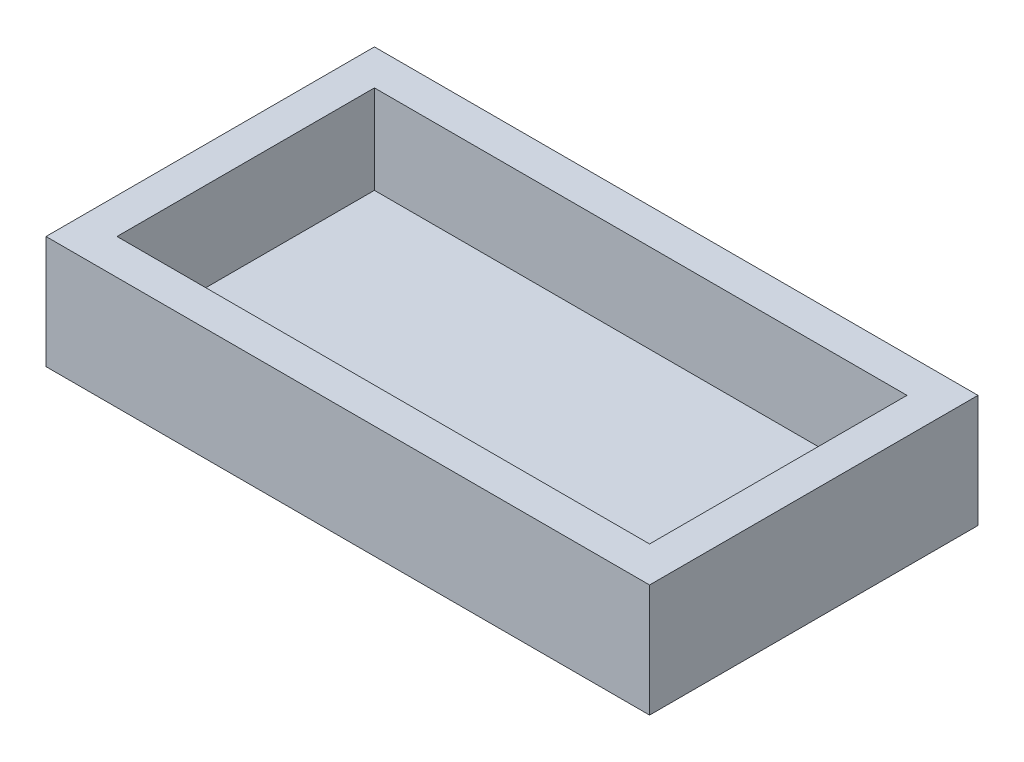
ISO-10303-21;
HEADER;
FILE_DESCRIPTION(('STEP AP214'),'2;1');
FILE_NAME('part.step','',(''),(''),'','','');
FILE_SCHEMA(('AUTOMOTIVE_DESIGN { 1 0 10303 214 1 1 1 1 }'));
ENDSEC;
DATA;
#1=APPLICATION_CONTEXT('core data for automotive mechanical design processes');
#2=APPLICATION_PROTOCOL_DEFINITION('international standard','automotive_design',2000,#1);
#3=PRODUCT_CONTEXT('',#1,'mechanical');
#4=PRODUCT('Part','Part','',(#3));
#5=PRODUCT_RELATED_PRODUCT_CATEGORY('part','',(#4));
#6=PRODUCT_DEFINITION_FORMATION('','',#4);
#7=PRODUCT_DEFINITION_CONTEXT('part definition',#1,'design');
#8=PRODUCT_DEFINITION('design','',#6,#7);
#9=PRODUCT_DEFINITION_SHAPE('','',#8);
#10=(LENGTH_UNIT() NAMED_UNIT(*) SI_UNIT(.MILLI.,.METRE.));
#11=(NAMED_UNIT(*) PLANE_ANGLE_UNIT() SI_UNIT($,.RADIAN.));
#12=(NAMED_UNIT(*) SI_UNIT($,.STERADIAN.) SOLID_ANGLE_UNIT());
#13=UNCERTAINTY_MEASURE_WITH_UNIT(LENGTH_MEASURE(1.E-05),#10,'distance_accuracy_value','');
#14=(GEOMETRIC_REPRESENTATION_CONTEXT(3) GLOBAL_UNCERTAINTY_ASSIGNED_CONTEXT((#13)) GLOBAL_UNIT_ASSIGNED_CONTEXT((#10,
#11,#12)) REPRESENTATION_CONTEXT('',''));
#15=CARTESIAN_POINT('',(0.,0.,0.));
#16=DIRECTION('',(0.,0.,1.));
#17=DIRECTION('',(1.,0.,0.));
#18=AXIS2_PLACEMENT_3D('',#15,#16,#17);
#19=CARTESIAN_POINT('',(30.,6.35,0.));
#20=DIRECTION('',(-1.,0.,0.));
#21=DIRECTION('',(0.,0.,1.));
#22=AXIS2_PLACEMENT_3D('',#19,#20,#21);
#23=PLANE('',#22);
#24=DIRECTION('',(0.,-1.,0.));
#25=VECTOR('',#24,1.);
#26=CARTESIAN_POINT('',(30.,6.35,-14.5));
#27=LINE('',#26,#25);
#28=CARTESIAN_POINT('',(30.,6.35,-14.5));
#29=VERTEX_POINT('',#28);
#30=CARTESIAN_POINT('',(30.,1.35,-14.5));
#31=VERTEX_POINT('',#30);
#32=EDGE_CURVE('E121',#29,#31,#27,.T.);
#33=ORIENTED_EDGE('',*,*,#32,.T.);
#34=DIRECTION('',(0.,0.,-1.));
#35=VECTOR('',#34,1.);
#36=CARTESIAN_POINT('',(30.,1.35,0.));
#37=LINE('',#36,#35);
#38=CARTESIAN_POINT('',(30.,1.35,0.));
#39=VERTEX_POINT('',#38);
#40=EDGE_CURVE('E106',#39,#31,#37,.T.);
#41=ORIENTED_EDGE('',*,*,#40,.F.);
#42=DIRECTION('',(0.,-1.,0.));
#43=VECTOR('',#42,1.);
#44=CARTESIAN_POINT('',(30.,6.35,0.));
#45=LINE('',#44,#43);
#46=CARTESIAN_POINT('',(30.,6.35,0.));
#47=VERTEX_POINT('',#46);
#48=EDGE_CURVE('E229',#47,#39,#45,.T.);
#49=ORIENTED_EDGE('',*,*,#48,.F.);
#50=DIRECTION('',(0.,0.,-1.));
#51=VECTOR('',#50,1.);
#52=CARTESIAN_POINT('',(30.,6.35,0.));
#53=LINE('',#52,#51);
#54=EDGE_CURVE('E128',#47,#29,#53,.T.);
#55=ORIENTED_EDGE('',*,*,#54,.T.);
#56=EDGE_LOOP('',(#33,#41,#49,#55));
#57=FACE_BOUND('',#56,.T.);
#58=ADVANCED_FACE('F42',(#57),#23,.T.);
#59=CARTESIAN_POINT('',(0.,6.35,-14.5));
#60=DIRECTION('',(0.,0.,1.));
#61=DIRECTION('',(1.,0.,0.));
#62=AXIS2_PLACEMENT_3D('',#59,#60,#61);
#63=PLANE('',#62);
#64=DIRECTION('',(0.,-1.,0.));
#65=VECTOR('',#64,1.);
#66=CARTESIAN_POINT('',(0.,6.35,-14.5));
#67=LINE('',#66,#65);
#68=CARTESIAN_POINT('',(0.,6.35,-14.5));
#69=VERTEX_POINT('',#68);
#70=CARTESIAN_POINT('',(0.,1.35,-14.5));
#71=VERTEX_POINT('',#70);
#72=EDGE_CURVE('E124',#69,#71,#67,.T.);
#73=ORIENTED_EDGE('',*,*,#72,.T.);
#74=DIRECTION('',(-1.,0.,0.));
#75=VECTOR('',#74,1.);
#76=CARTESIAN_POINT('',(0.,1.35,-14.5));
#77=LINE('',#76,#75);
#78=EDGE_CURVE('E109',#31,#71,#77,.T.);
#79=ORIENTED_EDGE('',*,*,#78,.F.);
#80=ORIENTED_EDGE('',*,*,#32,.F.);
#81=DIRECTION('',(-1.,0.,0.));
#82=VECTOR('',#81,1.);
#83=CARTESIAN_POINT('',(0.,6.35,-14.5));
#84=LINE('',#83,#82);
#85=EDGE_CURVE('E238',#29,#69,#84,.T.);
#86=ORIENTED_EDGE('',*,*,#85,.T.);
#87=EDGE_LOOP('',(#73,#79,#80,#86));
#88=FACE_BOUND('',#87,.T.);
#89=ADVANCED_FACE('F120',(#88),#63,.T.);
#90=CARTESIAN_POINT('',(0.,6.35,0.));
#91=DIRECTION('',(1.,0.,0.));
#92=DIRECTION('',(0.,0.,-1.));
#93=AXIS2_PLACEMENT_3D('',#90,#91,#92);
#94=PLANE('',#93);
#95=DIRECTION('',(0.,-1.,0.));
#96=VECTOR('',#95,1.);
#97=CARTESIAN_POINT('',(0.,6.35,0.));
#98=LINE('',#97,#96);
#99=CARTESIAN_POINT('',(0.,6.35,0.));
#100=VERTEX_POINT('',#99);
#101=CARTESIAN_POINT('',(0.,1.35,0.));
#102=VERTEX_POINT('',#101);
#103=EDGE_CURVE('E65',#100,#102,#98,.T.);
#104=ORIENTED_EDGE('',*,*,#103,.T.);
#105=DIRECTION('',(0.,0.,1.));
#106=VECTOR('',#105,1.);
#107=CARTESIAN_POINT('',(0.,1.35,0.));
#108=LINE('',#107,#106);
#109=EDGE_CURVE('E58',#71,#102,#108,.T.);
#110=ORIENTED_EDGE('',*,*,#109,.F.);
#111=ORIENTED_EDGE('',*,*,#72,.F.);
#112=DIRECTION('',(0.,0.,1.));
#113=VECTOR('',#112,1.);
#114=CARTESIAN_POINT('',(0.,6.35,0.));
#115=LINE('',#114,#113);
#116=EDGE_CURVE('E226',#69,#100,#115,.T.);
#117=ORIENTED_EDGE('',*,*,#116,.T.);
#118=EDGE_LOOP('',(#104,#110,#111,#117));
#119=FACE_BOUND('',#118,.T.);
#120=ADVANCED_FACE('F203',(#119),#94,.T.);
#121=CARTESIAN_POINT('',(0.,6.35,0.));
#122=DIRECTION('',(0.,0.,-1.));
#123=DIRECTION('',(-1.,0.,0.));
#124=AXIS2_PLACEMENT_3D('',#121,#122,#123);
#125=PLANE('',#124);
#126=ORIENTED_EDGE('',*,*,#48,.T.);
#127=DIRECTION('',(1.,0.,0.));
#128=VECTOR('',#127,1.);
#129=CARTESIAN_POINT('',(0.,1.35,0.));
#130=LINE('',#129,#128);
#131=EDGE_CURVE('E110',#102,#39,#130,.T.);
#132=ORIENTED_EDGE('',*,*,#131,.F.);
#133=ORIENTED_EDGE('',*,*,#103,.F.);
#134=DIRECTION('',(1.,0.,0.));
#135=VECTOR('',#134,1.);
#136=CARTESIAN_POINT('',(0.,6.35,0.));
#137=LINE('',#136,#135);
#138=EDGE_CURVE('E231',#100,#47,#137,.T.);
#139=ORIENTED_EDGE('',*,*,#138,.T.);
#140=EDGE_LOOP('',(#126,#132,#133,#139));
#141=FACE_BOUND('',#140,.T.);
#142=ADVANCED_FACE('F209',(#141),#125,.T.);
#143=CARTESIAN_POINT('',(0.,6.35,0.));
#144=DIRECTION('',(0.,1.,0.));
#145=DIRECTION('',(0.,0.,1.));
#146=AXIS2_PLACEMENT_3D('',#143,#144,#145);
#147=PLANE('',#146);
#148=DIRECTION('',(1.,0.,0.));
#149=VECTOR('',#148,1.);
#150=CARTESIAN_POINT('',(-2.,6.35,2.));
#151=LINE('',#150,#149);
#152=CARTESIAN_POINT('',(-2.,6.35,2.));
#153=VERTEX_POINT('',#152);
#154=CARTESIAN_POINT('',(32.,6.35,2.));
#155=VERTEX_POINT('',#154);
#156=EDGE_CURVE('E140',#153,#155,#151,.T.);
#157=ORIENTED_EDGE('',*,*,#156,.T.);
#158=DIRECTION('',(0.,0.,-1.));
#159=VECTOR('',#158,1.);
#160=CARTESIAN_POINT('',(32.,6.35,2.));
#161=LINE('',#160,#159);
#162=CARTESIAN_POINT('',(32.,6.35,-16.5));
#163=VERTEX_POINT('',#162);
#164=EDGE_CURVE('E144',#155,#163,#161,.T.);
#165=ORIENTED_EDGE('',*,*,#164,.T.);
#166=DIRECTION('',(-1.,0.,0.));
#167=VECTOR('',#166,1.);
#168=CARTESIAN_POINT('',(-2.,6.35,-16.5));
#169=LINE('',#168,#167);
#170=CARTESIAN_POINT('',(-2.,6.35,-16.5));
#171=VERTEX_POINT('',#170);
#172=EDGE_CURVE('E148',#163,#171,#169,.T.);
#173=ORIENTED_EDGE('',*,*,#172,.T.);
#174=DIRECTION('',(0.,0.,1.));
#175=VECTOR('',#174,1.);
#176=CARTESIAN_POINT('',(-2.,6.35,2.));
#177=LINE('',#176,#175);
#178=EDGE_CURVE('E151',#171,#153,#177,.T.);
#179=ORIENTED_EDGE('',*,*,#178,.T.);
#180=EDGE_LOOP('',(#157,#165,#173,#179));
#181=FACE_BOUND('',#180,.T.);
#182=ORIENTED_EDGE('',*,*,#85,.F.);
#183=ORIENTED_EDGE('',*,*,#54,.F.);
#184=ORIENTED_EDGE('',*,*,#138,.F.);
#185=ORIENTED_EDGE('',*,*,#116,.F.);
#186=EDGE_LOOP('',(#182,#183,#184,#185));
#187=FACE_BOUND('',#186,.T.);
#188=ADVANCED_FACE('F189',(#181,#187),#147,.T.);
#189=CARTESIAN_POINT('',(0.,0.,0.));
#190=DIRECTION('',(0.,1.,0.));
#191=DIRECTION('',(0.,0.,1.));
#192=AXIS2_PLACEMENT_3D('',#189,#190,#191);
#193=PLANE('',#192);
#194=DIRECTION('',(1.,0.,0.));
#195=VECTOR('',#194,1.);
#196=CARTESIAN_POINT('',(-2.,0.,2.));
#197=LINE('',#196,#195);
#198=CARTESIAN_POINT('',(-2.,0.,2.));
#199=VERTEX_POINT('',#198);
#200=CARTESIAN_POINT('',(32.,0.,2.));
#201=VERTEX_POINT('',#200);
#202=EDGE_CURVE('E130',#199,#201,#197,.T.);
#203=ORIENTED_EDGE('',*,*,#202,.F.);
#204=DIRECTION('',(0.,0.,1.));
#205=VECTOR('',#204,1.);
#206=CARTESIAN_POINT('',(-2.,0.,2.));
#207=LINE('',#206,#205);
#208=CARTESIAN_POINT('',(-2.,0.,-16.5));
#209=VERTEX_POINT('',#208);
#210=EDGE_CURVE('E145',#209,#199,#207,.T.);
#211=ORIENTED_EDGE('',*,*,#210,.F.);
#212=DIRECTION('',(-1.,0.,0.));
#213=VECTOR('',#212,1.);
#214=CARTESIAN_POINT('',(-2.,0.,-16.5));
#215=LINE('',#214,#213);
#216=CARTESIAN_POINT('',(32.,0.,-16.5));
#217=VERTEX_POINT('',#216);
#218=EDGE_CURVE('E157',#217,#209,#215,.T.);
#219=ORIENTED_EDGE('',*,*,#218,.F.);
#220=DIRECTION('',(0.,0.,-1.));
#221=VECTOR('',#220,1.);
#222=CARTESIAN_POINT('',(32.,0.,2.));
#223=LINE('',#222,#221);
#224=EDGE_CURVE('E135',#201,#217,#223,.T.);
#225=ORIENTED_EDGE('',*,*,#224,.F.);
#226=EDGE_LOOP('',(#203,#211,#219,#225));
#227=FACE_BOUND('',#226,.T.);
#228=ADVANCED_FACE('F180',(#227),#193,.F.);
#229=CARTESIAN_POINT('',(-2.,6.35,2.));
#230=DIRECTION('',(0.,0.,-1.));
#231=DIRECTION('',(-1.,0.,0.));
#232=AXIS2_PLACEMENT_3D('',#229,#230,#231);
#233=PLANE('',#232);
#234=ORIENTED_EDGE('',*,*,#202,.T.);
#235=DIRECTION('',(0.,-1.,0.));
#236=VECTOR('',#235,1.);
#237=CARTESIAN_POINT('',(32.,6.35,2.));
#238=LINE('',#237,#236);
#239=EDGE_CURVE('E11',#155,#201,#238,.T.);
#240=ORIENTED_EDGE('',*,*,#239,.F.);
#241=ORIENTED_EDGE('',*,*,#156,.F.);
#242=DIRECTION('',(0.,-1.,0.));
#243=VECTOR('',#242,1.);
#244=CARTESIAN_POINT('',(-2.,6.35,2.));
#245=LINE('',#244,#243);
#246=EDGE_CURVE('E153',#153,#199,#245,.T.);
#247=ORIENTED_EDGE('',*,*,#246,.T.);
#248=EDGE_LOOP('',(#234,#240,#241,#247));
#249=FACE_BOUND('',#248,.T.);
#250=ADVANCED_FACE('F44',(#249),#233,.F.);
#251=CARTESIAN_POINT('',(32.,6.35,2.));
#252=DIRECTION('',(-1.,0.,0.));
#253=DIRECTION('',(0.,0.,1.));
#254=AXIS2_PLACEMENT_3D('',#251,#252,#253);
#255=PLANE('',#254);
#256=ORIENTED_EDGE('',*,*,#224,.T.);
#257=DIRECTION('',(0.,-1.,0.));
#258=VECTOR('',#257,1.);
#259=CARTESIAN_POINT('',(32.,6.35,-16.5));
#260=LINE('',#259,#258);
#261=EDGE_CURVE('E51',#163,#217,#260,.T.);
#262=ORIENTED_EDGE('',*,*,#261,.F.);
#263=ORIENTED_EDGE('',*,*,#164,.F.);
#264=ORIENTED_EDGE('',*,*,#239,.T.);
#265=EDGE_LOOP('',(#256,#262,#263,#264));
#266=FACE_BOUND('',#265,.T.);
#267=ADVANCED_FACE('F191',(#266),#255,.F.);
#268=CARTESIAN_POINT('',(-2.,6.35,-16.5));
#269=DIRECTION('',(0.,0.,1.));
#270=DIRECTION('',(1.,0.,0.));
#271=AXIS2_PLACEMENT_3D('',#268,#269,#270);
#272=PLANE('',#271);
#273=ORIENTED_EDGE('',*,*,#218,.T.);
#274=DIRECTION('',(0.,-1.,0.));
#275=VECTOR('',#274,1.);
#276=CARTESIAN_POINT('',(-2.,6.35,-16.5));
#277=LINE('',#276,#275);
#278=EDGE_CURVE('E165',#171,#209,#277,.T.);
#279=ORIENTED_EDGE('',*,*,#278,.F.);
#280=ORIENTED_EDGE('',*,*,#172,.F.);
#281=ORIENTED_EDGE('',*,*,#261,.T.);
#282=EDGE_LOOP('',(#273,#279,#280,#281));
#283=FACE_BOUND('',#282,.T.);
#284=ADVANCED_FACE('F174',(#283),#272,.F.);
#285=CARTESIAN_POINT('',(-2.,6.35,2.));
#286=DIRECTION('',(1.,0.,0.));
#287=DIRECTION('',(0.,0.,-1.));
#288=AXIS2_PLACEMENT_3D('',#285,#286,#287);
#289=PLANE('',#288);
#290=ORIENTED_EDGE('',*,*,#210,.T.);
#291=ORIENTED_EDGE('',*,*,#246,.F.);
#292=ORIENTED_EDGE('',*,*,#178,.F.);
#293=ORIENTED_EDGE('',*,*,#278,.T.);
#294=EDGE_LOOP('',(#290,#291,#292,#293));
#295=FACE_BOUND('',#294,.T.);
#296=ADVANCED_FACE('F183',(#295),#289,.F.);
#297=CARTESIAN_POINT('',(0.,1.35,0.));
#298=DIRECTION('',(0.,-1.,0.));
#299=DIRECTION('',(0.,0.,-1.));
#300=AXIS2_PLACEMENT_3D('',#297,#298,#299);
#301=PLANE('',#300);
#302=ORIENTED_EDGE('',*,*,#40,.T.);
#303=ORIENTED_EDGE('',*,*,#78,.T.);
#304=ORIENTED_EDGE('',*,*,#109,.T.);
#305=ORIENTED_EDGE('',*,*,#131,.T.);
#306=EDGE_LOOP('',(#302,#303,#304,#305));
#307=FACE_BOUND('',#306,.T.);
#308=ADVANCED_FACE('F108',(#307),#301,.F.);
#309=CLOSED_SHELL('',(#58,#89,#120,#142,#188,#228,#250,#267,#284,#296,#308));
#310=MANIFOLD_SOLID_BREP('B2',#309);
#311=ADVANCED_BREP_SHAPE_REPRESENTATION('',(#18,#310),#14);
#312=SHAPE_DEFINITION_REPRESENTATION(#9,#311);
ENDSEC;
END-ISO-10303-21;
